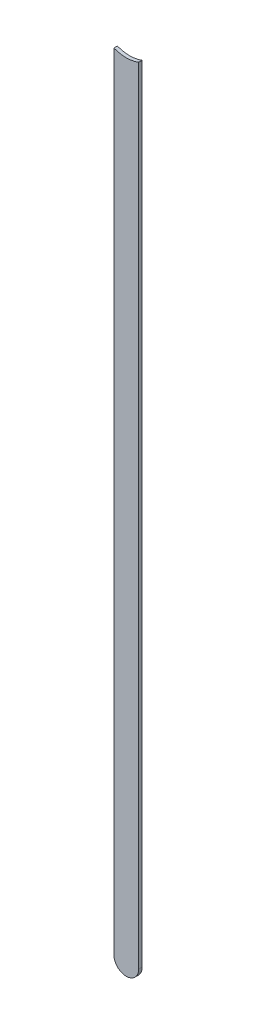
ISO-10303-21;
HEADER;
FILE_DESCRIPTION(('STEP AP214'),'2;1');
FILE_NAME('part.step','',(''),(''),'','','');
FILE_SCHEMA(('AUTOMOTIVE_DESIGN { 1 0 10303 214 1 1 1 1 }'));
ENDSEC;
DATA;
#1=APPLICATION_CONTEXT('core data for automotive mechanical design processes');
#2=APPLICATION_PROTOCOL_DEFINITION('international standard','automotive_design',2000,#1);
#3=PRODUCT_CONTEXT('',#1,'mechanical');
#4=PRODUCT('Part','Part','',(#3));
#5=PRODUCT_RELATED_PRODUCT_CATEGORY('part','',(#4));
#6=PRODUCT_DEFINITION_FORMATION('','',#4);
#7=PRODUCT_DEFINITION_CONTEXT('part definition',#1,'design');
#8=PRODUCT_DEFINITION('design','',#6,#7);
#9=PRODUCT_DEFINITION_SHAPE('','',#8);
#10=(LENGTH_UNIT() NAMED_UNIT(*) SI_UNIT(.MILLI.,.METRE.));
#11=(NAMED_UNIT(*) PLANE_ANGLE_UNIT() SI_UNIT($,.RADIAN.));
#12=(NAMED_UNIT(*) SI_UNIT($,.STERADIAN.) SOLID_ANGLE_UNIT());
#13=UNCERTAINTY_MEASURE_WITH_UNIT(LENGTH_MEASURE(1.E-05),#10,'distance_accuracy_value','');
#14=(GEOMETRIC_REPRESENTATION_CONTEXT(3) GLOBAL_UNCERTAINTY_ASSIGNED_CONTEXT((#13)) GLOBAL_UNIT_ASSIGNED_CONTEXT((#10,
#11,#12)) REPRESENTATION_CONTEXT('',''));
#15=CARTESIAN_POINT('',(0.,0.,0.));
#16=DIRECTION('',(0.,0.,1.));
#17=DIRECTION('',(1.,0.,0.));
#18=AXIS2_PLACEMENT_3D('',#15,#16,#17);
#19=CARTESIAN_POINT('',(94.54390032,92.7868985,0.));
#20=DIRECTION('',(-1.,0.,0.));
#21=DIRECTION('',(0.,1.,0.));
#22=AXIS2_PLACEMENT_3D('',#19,#20,#21);
#23=PLANE('',#22);
#24=DIRECTION('',(0.,1.,0.));
#25=VECTOR('',#24,1.);
#26=CARTESIAN_POINT('',(94.54390032,92.7868985,0.03556));
#27=LINE('',#26,#25);
#28=CARTESIAN_POINT('',(94.54390032,92.7868985,0.03556));
#29=VERTEX_POINT('',#28);
#30=CARTESIAN_POINT('',(94.54390032,100.854898700502,0.03556));
#31=VERTEX_POINT('',#30);
#32=EDGE_CURVE('E11',#29,#31,#27,.T.);
#33=ORIENTED_EDGE('',*,*,#32,.F.);
#34=DIRECTION('',(0.,0.,1.));
#35=VECTOR('',#34,1.);
#36=CARTESIAN_POINT('',(94.54390032,92.7868985,0.));
#37=LINE('',#36,#35);
#38=CARTESIAN_POINT('',(94.54390032,92.7868985,0.));
#39=VERTEX_POINT('',#38);
#40=EDGE_CURVE('E24',#39,#29,#37,.T.);
#41=ORIENTED_EDGE('',*,*,#40,.F.);
#42=DIRECTION('',(0.,1.,0.));
#43=VECTOR('',#42,1.);
#44=CARTESIAN_POINT('',(94.54390032,92.7868985,0.));
#45=LINE('',#44,#43);
#46=CARTESIAN_POINT('',(94.54390032,100.854898700502,0.));
#47=VERTEX_POINT('',#46);
#48=EDGE_CURVE('E75',#39,#47,#45,.T.);
#49=ORIENTED_EDGE('',*,*,#48,.T.);
#50=DIRECTION('',(0.,0.,1.));
#51=VECTOR('',#50,1.);
#52=CARTESIAN_POINT('',(94.54390032,100.854898700502,0.));
#53=LINE('',#52,#51);
#54=EDGE_CURVE('E37',#47,#31,#53,.T.);
#55=ORIENTED_EDGE('',*,*,#54,.T.);
#56=EDGE_LOOP('',(#33,#41,#49,#55));
#57=FACE_BOUND('',#56,.T.);
#58=ADVANCED_FACE('F17',(#57),#23,.F.);
#59=CARTESIAN_POINT('',(94.41690032,101.1870468,0.));
#60=DIRECTION('',(0.,0.,-1.));
#61=DIRECTION('',(1.,0.,0.));
#62=AXIS2_PLACEMENT_3D('',#59,#60,#61);
#63=CYLINDRICAL_SURFACE('',#62,0.3556);
#64=DIRECTION('',(0.,0.,1.));
#65=VECTOR('',#64,1.);
#66=CARTESIAN_POINT('',(94.28990032,100.854898700502,0.));
#67=LINE('',#66,#65);
#68=CARTESIAN_POINT('',(94.28990032,100.854898700502,0.));
#69=VERTEX_POINT('',#68);
#70=CARTESIAN_POINT('',(94.28990032,100.854898700502,0.03556));
#71=VERTEX_POINT('',#70);
#72=EDGE_CURVE('E67',#69,#71,#67,.T.);
#73=ORIENTED_EDGE('',*,*,#72,.T.);
#74=CARTESIAN_POINT('',(94.41690032,101.1870468,0.03556));
#75=DIRECTION('',(0.,0.,1.));
#76=DIRECTION('',(1.,0.,0.));
#77=AXIS2_PLACEMENT_3D('',#74,#75,#76);
#78=CIRCLE('',#77,0.3556);
#79=EDGE_CURVE('E82',#71,#31,#78,.T.);
#80=ORIENTED_EDGE('',*,*,#79,.T.);
#81=ORIENTED_EDGE('',*,*,#54,.F.);
#82=CARTESIAN_POINT('',(94.41690032,101.1870468,0.));
#83=DIRECTION('',(0.,0.,1.));
#84=DIRECTION('',(1.,0.,0.));
#85=AXIS2_PLACEMENT_3D('',#82,#83,#84);
#86=CIRCLE('',#85,0.3556);
#87=EDGE_CURVE('E80',#69,#47,#86,.T.);
#88=ORIENTED_EDGE('',*,*,#87,.F.);
#89=EDGE_LOOP('',(#73,#80,#81,#88));
#90=FACE_BOUND('',#89,.T.);
#91=ADVANCED_FACE('F88',(#90),#63,.F.);
#92=CARTESIAN_POINT('',(94.28990032,100.854898700502,0.));
#93=DIRECTION('',(1.,0.,0.));
#94=DIRECTION('',(0.,-1.,0.));
#95=AXIS2_PLACEMENT_3D('',#92,#93,#94);
#96=PLANE('',#95);
#97=DIRECTION('',(0.,-1.,0.));
#98=VECTOR('',#97,1.);
#99=CARTESIAN_POINT('',(94.28990032,101.1870468,0.03556));
#100=LINE('',#99,#98);
#101=CARTESIAN_POINT('',(94.28990032,92.7868985,0.03556));
#102=VERTEX_POINT('',#101);
#103=EDGE_CURVE('E71',#71,#102,#100,.T.);
#104=ORIENTED_EDGE('',*,*,#103,.F.);
#105=ORIENTED_EDGE('',*,*,#72,.F.);
#106=DIRECTION('',(0.,-1.,0.));
#107=VECTOR('',#106,1.);
#108=CARTESIAN_POINT('',(94.28990032,101.1870468,0.));
#109=LINE('',#108,#107);
#110=CARTESIAN_POINT('',(94.28990032,92.7868985,0.));
#111=VERTEX_POINT('',#110);
#112=EDGE_CURVE('E63',#69,#111,#109,.T.);
#113=ORIENTED_EDGE('',*,*,#112,.T.);
#114=DIRECTION('',(0.,0.,1.));
#115=VECTOR('',#114,1.);
#116=CARTESIAN_POINT('',(94.28990032,92.7868985,0.));
#117=LINE('',#116,#115);
#118=EDGE_CURVE('E53',#111,#102,#117,.T.);
#119=ORIENTED_EDGE('',*,*,#118,.T.);
#120=EDGE_LOOP('',(#104,#105,#113,#119));
#121=FACE_BOUND('',#120,.T.);
#122=ADVANCED_FACE('F66',(#121),#96,.F.);
#123=CARTESIAN_POINT('',(94.41690032,92.7868985,0.));
#124=DIRECTION('',(0.,0.,-1.));
#125=DIRECTION('',(-1.,-1.1189649382048E-13,0.));
#126=AXIS2_PLACEMENT_3D('',#123,#124,#125);
#127=CYLINDRICAL_SURFACE('',#126,0.127000000000005);
#128=CARTESIAN_POINT('',(94.41690032,92.7868985,0.03556));
#129=DIRECTION('',(0.,0.,1.));
#130=DIRECTION('',(-1.,-1.1189649382048E-13,0.));
#131=AXIS2_PLACEMENT_3D('',#128,#129,#130);
#132=CIRCLE('',#131,0.127000000000005);
#133=EDGE_CURVE('E59',#102,#29,#132,.T.);
#134=ORIENTED_EDGE('',*,*,#133,.F.);
#135=ORIENTED_EDGE('',*,*,#118,.F.);
#136=CARTESIAN_POINT('',(94.41690032,92.7868985,0.));
#137=DIRECTION('',(0.,0.,1.));
#138=DIRECTION('',(-1.,-1.1189649382048E-13,0.));
#139=AXIS2_PLACEMENT_3D('',#136,#137,#138);
#140=CIRCLE('',#139,0.127000000000005);
#141=EDGE_CURVE('E57',#111,#39,#140,.T.);
#142=ORIENTED_EDGE('',*,*,#141,.T.);
#143=ORIENTED_EDGE('',*,*,#40,.T.);
#144=EDGE_LOOP('',(#134,#135,#142,#143));
#145=FACE_BOUND('',#144,.T.);
#146=ADVANCED_FACE('F55',(#145),#127,.T.);
#147=CARTESIAN_POINT('',(94.54390032,92.7868985,0.));
#148=DIRECTION('',(0.,0.,-1.));
#149=DIRECTION('',(-1.,0.,0.));
#150=AXIS2_PLACEMENT_3D('',#147,#148,#149);
#151=PLANE('',#150);
#152=ORIENTED_EDGE('',*,*,#48,.F.);
#153=ORIENTED_EDGE('',*,*,#141,.F.);
#154=ORIENTED_EDGE('',*,*,#112,.F.);
#155=ORIENTED_EDGE('',*,*,#87,.T.);
#156=EDGE_LOOP('',(#152,#153,#154,#155));
#157=FACE_BOUND('',#156,.T.);
#158=ADVANCED_FACE('F74',(#157),#151,.T.);
#159=CARTESIAN_POINT('',(94.54390032,92.7868985,0.03556));
#160=DIRECTION('',(0.,0.,-1.));
#161=DIRECTION('',(-1.,0.,0.));
#162=AXIS2_PLACEMENT_3D('',#159,#160,#161);
#163=PLANE('',#162);
#164=ORIENTED_EDGE('',*,*,#133,.T.);
#165=ORIENTED_EDGE('',*,*,#32,.T.);
#166=ORIENTED_EDGE('',*,*,#79,.F.);
#167=ORIENTED_EDGE('',*,*,#103,.T.);
#168=EDGE_LOOP('',(#164,#165,#166,#167));
#169=FACE_BOUND('',#168,.T.);
#170=ADVANCED_FACE('F91',(#169),#163,.F.);
#171=CLOSED_SHELL('',(#58,#91,#122,#146,#158,#170));
#172=MANIFOLD_SOLID_BREP('B1',#171);
#173=ADVANCED_BREP_SHAPE_REPRESENTATION('',(#18,#172),#14);
#174=SHAPE_DEFINITION_REPRESENTATION(#9,#173);
ENDSEC;
END-ISO-10303-21;
